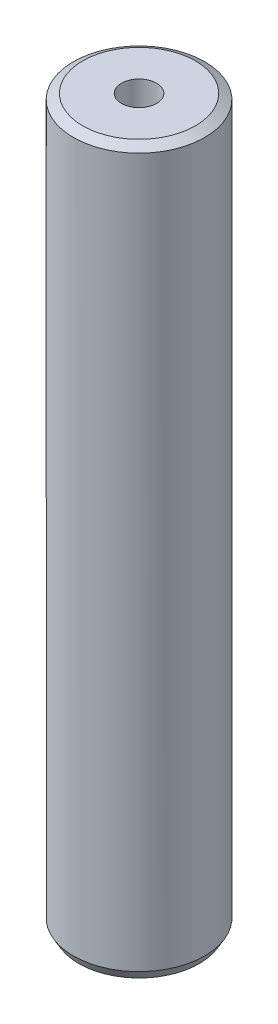
ISO-10303-21;
HEADER;
FILE_DESCRIPTION(('STEP AP214'),'2;1');
FILE_NAME('part.step','',(''),(''),'','','');
FILE_SCHEMA(('AUTOMOTIVE_DESIGN { 1 0 10303 214 1 1 1 1 }'));
ENDSEC;
DATA;
#1=APPLICATION_CONTEXT('core data for automotive mechanical design processes');
#2=APPLICATION_PROTOCOL_DEFINITION('international standard','automotive_design',2000,#1);
#3=PRODUCT_CONTEXT('',#1,'mechanical');
#4=PRODUCT('Part','Part','',(#3));
#5=PRODUCT_RELATED_PRODUCT_CATEGORY('part','',(#4));
#6=PRODUCT_DEFINITION_FORMATION('','',#4);
#7=PRODUCT_DEFINITION_CONTEXT('part definition',#1,'design');
#8=PRODUCT_DEFINITION('design','',#6,#7);
#9=PRODUCT_DEFINITION_SHAPE('','',#8);
#10=(LENGTH_UNIT() NAMED_UNIT(*) SI_UNIT(.MILLI.,.METRE.));
#11=(NAMED_UNIT(*) PLANE_ANGLE_UNIT() SI_UNIT($,.RADIAN.));
#12=(NAMED_UNIT(*) SI_UNIT($,.STERADIAN.) SOLID_ANGLE_UNIT());
#13=UNCERTAINTY_MEASURE_WITH_UNIT(LENGTH_MEASURE(1.E-05),#10,'distance_accuracy_value','');
#14=(GEOMETRIC_REPRESENTATION_CONTEXT(3) GLOBAL_UNCERTAINTY_ASSIGNED_CONTEXT((#13)) GLOBAL_UNIT_ASSIGNED_CONTEXT((#10,
#11,#12)) REPRESENTATION_CONTEXT('',''));
#15=CARTESIAN_POINT('',(0.,0.,0.));
#16=DIRECTION('',(0.,0.,1.));
#17=DIRECTION('',(1.,0.,0.));
#18=AXIS2_PLACEMENT_3D('',#15,#16,#17);
#19=CARTESIAN_POINT('',(0.,110.16894123625,0.));
#20=DIRECTION('',(0.,-1.,0.));
#21=DIRECTION('',(0.,0.,-1.));
#22=AXIS2_PLACEMENT_3D('',#19,#20,#21);
#23=CYLINDRICAL_SURFACE('',#22,10.);
#24=CARTESIAN_POINT('',(0.,109.347230085721,0.));
#25=DIRECTION('',(0.,1.,0.));
#26=DIRECTION('',(0.,0.,1.));
#27=AXIS2_PLACEMENT_3D('',#24,#25,#26);
#28=CIRCLE('',#27,10.);
#29=CARTESIAN_POINT('',(0.,109.347230085721,-10.));
#30=VERTEX_POINT('',#29);
#31=EDGE_CURVE('E50',#30,#30,#28,.F.);
#32=CARTESIAN_POINT('',(0.,1.42324546186122,0.));
#33=DIRECTION('',(0.,1.,0.));
#34=DIRECTION('',(0.,0.,1.));
#35=AXIS2_PLACEMENT_3D('',#32,#33,#34);
#36=CIRCLE('',#35,10.);
#37=CARTESIAN_POINT('',(0.,1.42324546186121,-10.));
#38=VERTEX_POINT('',#37);
#39=EDGE_CURVE('E51',#38,#38,#36,.T.);
#40=CARTESIAN_POINT('',(0.,109.347230085721,-10.));
#41=CARTESIAN_POINT('',(0.,108.223021912556,-10.));
#42=CARTESIAN_POINT('',(0.,107.098813739391,-10.));
#43=CARTESIAN_POINT('',(0.,104.850397393061,-10.));
#44=CARTESIAN_POINT('',(0.,103.726189219895,-10.));
#45=CARTESIAN_POINT('',(0.,101.477772873565,-10.));
#46=CARTESIAN_POINT('',(0.,100.3535647004,-10.));
#47=CARTESIAN_POINT('',(0.,98.1051483540693,-10.));
#48=CARTESIAN_POINT('',(0.,96.9809401809041,-10.));
#49=CARTESIAN_POINT('',(0.,94.7325238345737,-10.));
#50=CARTESIAN_POINT('',(0.,93.6083156614085,-10.));
#51=CARTESIAN_POINT('',(0.,91.3598993150781,-10.));
#52=CARTESIAN_POINT('',(0.,90.2356911419128,-10.));
#53=CARTESIAN_POINT('',(0.,87.9872747955824,-10.));
#54=CARTESIAN_POINT('',(0.,86.8630666224172,-10.));
#55=CARTESIAN_POINT('',(0.,84.6146502760868,-10.));
#56=CARTESIAN_POINT('',(0.,83.4904421029216,-10.));
#57=CARTESIAN_POINT('',(0.,81.2420257565912,-10.));
#58=CARTESIAN_POINT('',(0.,80.1178175834259,-10.));
#59=CARTESIAN_POINT('',(0.,77.8694012370955,-10.));
#60=CARTESIAN_POINT('',(0.,76.7451930639303,-10.));
#61=CARTESIAN_POINT('',(0.,74.4967767175999,-10.));
#62=CARTESIAN_POINT('',(0.,73.3725685444347,-10.));
#63=CARTESIAN_POINT('',(0.,71.1241521981043,-10.));
#64=CARTESIAN_POINT('',(0.,69.999944024939,-10.));
#65=CARTESIAN_POINT('',(0.,67.7515276786086,-10.));
#66=CARTESIAN_POINT('',(0.,66.6273195054434,-10.));
#67=CARTESIAN_POINT('',(0.,64.378903159113,-10.));
#68=CARTESIAN_POINT('',(0.,63.2546949859478,-10.));
#69=CARTESIAN_POINT('',(0.,61.0062786396174,-10.));
#70=CARTESIAN_POINT('',(0.,59.8820704664522,-10.));
#71=CARTESIAN_POINT('',(0.,57.6336541201217,-10.));
#72=CARTESIAN_POINT('',(0.,56.5094459469565,-10.));
#73=CARTESIAN_POINT('',(0.,54.2610296006261,-10.));
#74=CARTESIAN_POINT('',(0.,53.1368214274609,-10.));
#75=CARTESIAN_POINT('',(0.,50.8884050811305,-10.));
#76=CARTESIAN_POINT('',(0.,49.7641969079653,-10.));
#77=CARTESIAN_POINT('',(0.,47.5157805616348,-10.));
#78=CARTESIAN_POINT('',(0.,46.3915723884696,-10.));
#79=CARTESIAN_POINT('',(0.,44.1431560421392,-10.));
#80=CARTESIAN_POINT('',(0.,43.018947868974,-10.));
#81=CARTESIAN_POINT('',(0.,40.7705315226436,-10.));
#82=CARTESIAN_POINT('',(0.,39.6463233494784,-10.));
#83=CARTESIAN_POINT('',(0.,37.3979070031479,-10.));
#84=CARTESIAN_POINT('',(0.,36.2736988299827,-10.));
#85=CARTESIAN_POINT('',(0.,34.0252824836523,-10.));
#86=CARTESIAN_POINT('',(0.,32.9010743104871,-10.));
#87=CARTESIAN_POINT('',(0.,30.6526579641567,-10.));
#88=CARTESIAN_POINT('',(0.,29.5284497909915,-10.));
#89=CARTESIAN_POINT('',(0.,27.2800334446611,-10.));
#90=CARTESIAN_POINT('',(0.,26.1558252714958,-10.));
#91=CARTESIAN_POINT('',(0.,23.9074089251654,-10.));
#92=CARTESIAN_POINT('',(0.,22.7832007520002,-10.));
#93=CARTESIAN_POINT('',(0.,20.5347844056698,-10.));
#94=CARTESIAN_POINT('',(0.,19.4105762325046,-10.));
#95=CARTESIAN_POINT('',(0.,17.1621598861742,-10.));
#96=CARTESIAN_POINT('',(0.,16.0379517130089,-10.));
#97=CARTESIAN_POINT('',(0.,13.7895353666785,-10.));
#98=CARTESIAN_POINT('',(0.,12.6653271935133,-10.));
#99=CARTESIAN_POINT('',(0.,10.4169108471829,-10.));
#100=CARTESIAN_POINT('',(0.,9.29270267401768,-10.));
#101=CARTESIAN_POINT('',(0.,7.04428632768726,-10.));
#102=CARTESIAN_POINT('',(0.,5.92007815452205,-10.));
#103=CARTESIAN_POINT('',(0.,3.67166180819163,-10.));
#104=CARTESIAN_POINT('',(0.,2.54745363502642,-10.));
#105=CARTESIAN_POINT('',(0.,1.42324546186121,-10.));
#106=B_SPLINE_CURVE_WITH_KNOTS('',3,(#40,#41,#42,#43,#44,#45,#46,#47,#48,#49,#50,#51,#52,#53,
#54,#55,#56,#57,#58,#59,#60,#61,#62,#63,#64,#65,#66,#67,#68,#69,#70,#71,#72,#73,#74,#75,#76,#77,
#78,#79,#80,#81,#82,#83,#84,#85,#86,#87,#88,#89,#90,#91,#92,#93,#94,#95,#96,#97,#98,#99,#100,
#101,#102,#103,#104,#105),.UNSPECIFIED.,.F.,.F.,(4,2,2,2,2,2,2,2,2,2,2,2,2,2,2,2,2,2,2,2,2,2,2,
2,2,2,2,2,2,2,2,2,4),(0.,3.37262451949565,6.74524903899128,10.1178735584869,13.4904980779825,
16.8631225974782,20.2357471169738,23.6083716364694,26.9809961559651,30.3536206754607,
33.7262451949563,37.098869714452,40.4714942339476,43.8441187534432,47.2167432729389,
50.5893677924345,53.9619923119301,57.3346168314258,60.7072413509214,64.079865870417,
67.4524903899127,70.8251149094083,74.1977394289039,77.5703639483995,80.9429884678952,
84.3156129873908,87.6882375068864,91.0608620263821,94.4334865458777,97.8061110653733,
101.178735584869,104.551360104365,107.92398462386),.UNSPECIFIED.);
#107=EDGE_CURVE('BSEAM39',#30,#38,#106,.T.);
#108=ORIENTED_EDGE('',*,*,#31,.T.);
#109=ORIENTED_EDGE('',*,*,#39,.T.);
#110=ORIENTED_EDGE('',*,*,#107,.T.);
#111=ORIENTED_EDGE('',*,*,#107,.F.);
#112=EDGE_LOOP('',(#108,#110,#109,#111));
#113=FACE_BOUND('',#112,.T.);
#114=ADVANCED_FACE('F39',(#113),#23,.T.);
#115=CARTESIAN_POINT('',(0.,110.16894123625,0.));
#116=DIRECTION('',(0.,1.,0.));
#117=DIRECTION('',(0.,0.,1.));
#118=AXIS2_PLACEMENT_3D('',#115,#116,#117);
#119=PLANE('',#118);
#120=CARTESIAN_POINT('',(0.,110.16894123625,0.));
#121=DIRECTION('',(0.,1.,0.));
#122=DIRECTION('',(0.,0.,1.));
#123=AXIS2_PLACEMENT_3D('',#120,#121,#122);
#124=CIRCLE('',#123,8.57675453813905);
#125=CARTESIAN_POINT('',(0.,110.16894123625,8.57675453813905));
#126=VERTEX_POINT('',#125);
#127=EDGE_CURVE('E54',#126,#126,#124,.T.);
#128=ORIENTED_EDGE('',*,*,#127,.T.);
#129=EDGE_LOOP('',(#128));
#130=FACE_BOUND('',#129,.T.);
#131=CARTESIAN_POINT('',(0.,110.16894123625,0.));
#132=DIRECTION('',(0.,1.,0.));
#133=DIRECTION('',(0.,0.,1.));
#134=AXIS2_PLACEMENT_3D('',#131,#132,#133);
#135=CIRCLE('',#134,2.6719420239943);
#136=CARTESIAN_POINT('',(0.,110.16894123625,-2.6719420239943));
#137=VERTEX_POINT('',#136);
#138=EDGE_CURVE('E58',#137,#137,#135,.T.);
#139=ORIENTED_EDGE('',*,*,#138,.F.);
#140=EDGE_LOOP('',(#139));
#141=FACE_BOUND('',#140,.T.);
#142=ADVANCED_FACE('F69',(#130,#141),#119,.T.);
#143=CARTESIAN_POINT('',(0.,0.,0.));
#144=DIRECTION('',(0.,1.,0.));
#145=DIRECTION('',(0.,0.,1.));
#146=AXIS2_PLACEMENT_3D('',#143,#144,#145);
#147=PLANE('',#146);
#148=CARTESIAN_POINT('',(0.,0.,0.));
#149=DIRECTION('',(0.,1.,0.));
#150=DIRECTION('',(0.,0.,1.));
#151=AXIS2_PLACEMENT_3D('',#148,#149,#150);
#152=CIRCLE('',#151,9.1782888494715);
#153=CARTESIAN_POINT('',(0.,0.,9.1782888494715));
#154=VERTEX_POINT('',#153);
#155=EDGE_CURVE('E10',#154,#154,#152,.F.);
#156=ORIENTED_EDGE('',*,*,#155,.T.);
#157=EDGE_LOOP('',(#156));
#158=FACE_BOUND('',#157,.T.);
#159=CARTESIAN_POINT('',(0.,0.,0.));
#160=DIRECTION('',(0.,1.,0.));
#161=DIRECTION('',(0.,0.,1.));
#162=AXIS2_PLACEMENT_3D('',#159,#160,#161);
#163=CIRCLE('',#162,2.6719420239943);
#164=CARTESIAN_POINT('',(0.,0.,-2.6719420239943));
#165=VERTEX_POINT('',#164);
#166=EDGE_CURVE('E63',#165,#165,#163,.T.);
#167=ORIENTED_EDGE('',*,*,#166,.T.);
#168=EDGE_LOOP('',(#167));
#169=FACE_BOUND('',#168,.T.);
#170=ADVANCED_FACE('F75',(#158,#169),#147,.F.);
#171=CARTESIAN_POINT('',(0.,110.16894123625,0.));
#172=DIRECTION('',(0.,-1.,0.));
#173=DIRECTION('',(0.,0.,-1.));
#174=AXIS2_PLACEMENT_3D('',#171,#172,#173);
#175=CYLINDRICAL_SURFACE('',#174,2.6719420239943);
#176=CARTESIAN_POINT('',(0.,110.16894123625,-2.6719420239943));
#177=CARTESIAN_POINT('',(0.,109.021348098372,-2.6719420239943));
#178=CARTESIAN_POINT('',(0.,107.873754960495,-2.6719420239943));
#179=CARTESIAN_POINT('',(0.,105.578568684739,-2.6719420239943));
#180=CARTESIAN_POINT('',(0.,104.430975546862,-2.6719420239943));
#181=CARTESIAN_POINT('',(0.,102.135789271107,-2.6719420239943));
#182=CARTESIAN_POINT('',(0.,100.988196133229,-2.6719420239943));
#183=CARTESIAN_POINT('',(0.,98.6930098574738,-2.6719420239943));
#184=CARTESIAN_POINT('',(0.,97.5454167195961,-2.6719420239943));
#185=CARTESIAN_POINT('',(0.,95.2502304438409,-2.6719420239943));
#186=CARTESIAN_POINT('',(0.,94.1026373059633,-2.6719420239943));
#187=CARTESIAN_POINT('',(0.,91.8074510302081,-2.6719420239943));
#188=CARTESIAN_POINT('',(0.,90.6598578923305,-2.6719420239943));
#189=CARTESIAN_POINT('',(0.,88.3646716165753,-2.6719420239943));
#190=CARTESIAN_POINT('',(0.,87.2170784786977,-2.6719420239943));
#191=CARTESIAN_POINT('',(0.,84.9218922029425,-2.6719420239943));
#192=CARTESIAN_POINT('',(0.,83.7742990650649,-2.6719420239943));
#193=CARTESIAN_POINT('',(0.,81.4791127893097,-2.6719420239943));
#194=CARTESIAN_POINT('',(0.,80.3315196514321,-2.6719420239943));
#195=CARTESIAN_POINT('',(0.,78.0363333756769,-2.6719420239943));
#196=CARTESIAN_POINT('',(0.,76.8887402377993,-2.6719420239943));
#197=CARTESIAN_POINT('',(0.,74.5935539620441,-2.6719420239943));
#198=CARTESIAN_POINT('',(0.,73.4459608241665,-2.6719420239943));
#199=CARTESIAN_POINT('',(0.,71.1507745484113,-2.6719420239943));
#200=CARTESIAN_POINT('',(0.,70.0031814105337,-2.6719420239943));
#201=CARTESIAN_POINT('',(0.,67.7079951347785,-2.6719420239943));
#202=CARTESIAN_POINT('',(0.,66.5604019969009,-2.6719420239943));
#203=CARTESIAN_POINT('',(0.,64.2652157211457,-2.6719420239943));
#204=CARTESIAN_POINT('',(0.,63.1176225832681,-2.6719420239943));
#205=CARTESIAN_POINT('',(0.,60.8224363075129,-2.6719420239943));
#206=CARTESIAN_POINT('',(0.,59.6748431696353,-2.6719420239943));
#207=CARTESIAN_POINT('',(0.,57.3796568938801,-2.6719420239943));
#208=CARTESIAN_POINT('',(0.,56.2320637560025,-2.6719420239943));
#209=CARTESIAN_POINT('',(0.,53.9368774802473,-2.6719420239943));
#210=CARTESIAN_POINT('',(0.,52.7892843423697,-2.6719420239943));
#211=CARTESIAN_POINT('',(0.,50.4940980666145,-2.6719420239943));
#212=CARTESIAN_POINT('',(0.,49.3465049287369,-2.6719420239943));
#213=CARTESIAN_POINT('',(0.,47.0513186529817,-2.6719420239943));
#214=CARTESIAN_POINT('',(0.,45.9037255151041,-2.6719420239943));
#215=CARTESIAN_POINT('',(0.,43.6085392393489,-2.6719420239943));
#216=CARTESIAN_POINT('',(0.,42.4609461014713,-2.6719420239943));
#217=CARTESIAN_POINT('',(0.,40.1657598257161,-2.6719420239943));
#218=CARTESIAN_POINT('',(0.,39.0181666878385,-2.6719420239943));
#219=CARTESIAN_POINT('',(0.,36.7229804120833,-2.6719420239943));
#220=CARTESIAN_POINT('',(0.,35.5753872742057,-2.6719420239943));
#221=CARTESIAN_POINT('',(0.,33.2802009984505,-2.6719420239943));
#222=CARTESIAN_POINT('',(0.,32.1326078605729,-2.6719420239943));
#223=CARTESIAN_POINT('',(0.,29.8374215848177,-2.6719420239943));
#224=CARTESIAN_POINT('',(0.,28.68982844694,-2.6719420239943));
#225=CARTESIAN_POINT('',(0.,26.3946421711848,-2.6719420239943));
#226=CARTESIAN_POINT('',(0.,25.2470490333072,-2.6719420239943));
#227=CARTESIAN_POINT('',(0.,22.951862757552,-2.6719420239943));
#228=CARTESIAN_POINT('',(0.,21.8042696196744,-2.6719420239943));
#229=CARTESIAN_POINT('',(0.,19.5090833439192,-2.6719420239943));
#230=CARTESIAN_POINT('',(0.,18.3614902060416,-2.6719420239943));
#231=CARTESIAN_POINT('',(0.,16.0663039302864,-2.6719420239943));
#232=CARTESIAN_POINT('',(0.,14.9187107924088,-2.6719420239943));
#233=CARTESIAN_POINT('',(0.,12.6235245166536,-2.6719420239943));
#234=CARTESIAN_POINT('',(0.,11.475931378776,-2.6719420239943));
#235=CARTESIAN_POINT('',(0.,9.18074510302082,-2.6719420239943));
#236=CARTESIAN_POINT('',(0.,8.03315196514322,-2.6719420239943));
#237=CARTESIAN_POINT('',(0.,5.73796568938801,-2.6719420239943));
#238=CARTESIAN_POINT('',(0.,4.59037255151041,-2.6719420239943));
#239=CARTESIAN_POINT('',(0.,2.2951862757552,-2.6719420239943));
#240=CARTESIAN_POINT('',(0.,1.1475931378776,-2.6719420239943));
#241=CARTESIAN_POINT('',(0.,0.,-2.6719420239943));
#242=B_SPLINE_CURVE_WITH_KNOTS('',3,(#176,#177,#178,#179,#180,#181,#182,#183,#184,#185,#186,
#187,#188,#189,#190,#191,#192,#193,#194,#195,#196,#197,#198,#199,#200,#201,#202,#203,#204,#205,
#206,#207,#208,#209,#210,#211,#212,#213,#214,#215,#216,#217,#218,#219,#220,#221,#222,#223,#224,
#225,#226,#227,#228,#229,#230,#231,#232,#233,#234,#235,#236,#237,#238,#239,#240,#241),
.UNSPECIFIED.,.F.,.F.,(4,2,2,2,2,2,2,2,2,2,2,2,2,2,2,2,2,2,2,2,2,2,2,2,2,2,2,2,2,2,2,2,4),(0.,
3.44277941363282,6.88555882726562,10.3283382408984,13.7711176545312,17.213897068164,
20.6566764817968,24.0994558954297,27.5422353090625,30.9850147226953,34.4277941363281,
37.8705735499609,41.3133529635937,44.7561323772265,48.1989117908593,51.6416912044921,
55.0844706181249,58.5272500317577,61.9700294453905,65.4128088590233,68.8555882726561,
72.2983676862889,75.7411470999217,79.1839265135545,82.6267059271873,86.0694853408201,
89.5122647544529,92.9550441680857,96.3978235817186,99.8406029953514,103.283382408984,
106.726161822617,110.16894123625),.UNSPECIFIED.);
#243=EDGE_CURVE('BSEAM70',#137,#165,#242,.T.);
#244=ORIENTED_EDGE('',*,*,#138,.T.);
#245=ORIENTED_EDGE('',*,*,#166,.F.);
#246=ORIENTED_EDGE('',*,*,#243,.T.);
#247=ORIENTED_EDGE('',*,*,#243,.F.);
#248=EDGE_LOOP('',(#244,#246,#245,#247));
#249=FACE_BOUND('',#248,.T.);
#250=ADVANCED_FACE('F70',(#249),#175,.F.);
#251=CARTESIAN_POINT('',(0.,110.16894123625,0.));
#252=DIRECTION('',(0.,-1.,0.));
#253=DIRECTION('',(0.,0.,-1.));
#254=AXIS2_PLACEMENT_3D('',#251,#252,#253);
#255=CONICAL_SURFACE('',#254,8.57675453813905,1.04719755119659);
#256=ORIENTED_EDGE('',*,*,#31,.F.);
#257=EDGE_LOOP('',(#256));
#258=FACE_BOUND('',#257,.T.);
#259=ORIENTED_EDGE('',*,*,#127,.F.);
#260=EDGE_LOOP('',(#259));
#261=FACE_BOUND('',#260,.T.);
#262=ADVANCED_FACE('F81',(#258,#261),#255,.T.);
#263=CARTESIAN_POINT('',(0.,1.42324546186122,0.));
#264=DIRECTION('',(0.,1.,0.));
#265=DIRECTION('',(0.,0.,1.));
#266=AXIS2_PLACEMENT_3D('',#263,#264,#265);
#267=CONICAL_SURFACE('',#266,10.,0.523598775598306);
#268=ORIENTED_EDGE('',*,*,#155,.F.);
#269=EDGE_LOOP('',(#268));
#270=FACE_BOUND('',#269,.T.);
#271=ORIENTED_EDGE('',*,*,#39,.F.);
#272=EDGE_LOOP('',(#271));
#273=FACE_BOUND('',#272,.T.);
#274=ADVANCED_FACE('F45',(#270,#273),#267,.T.);
#275=CLOSED_SHELL('',(#114,#142,#170,#250,#262,#274));
#276=MANIFOLD_SOLID_BREP('B2',#275);
#277=ADVANCED_BREP_SHAPE_REPRESENTATION('',(#18,#276),#14);
#278=SHAPE_DEFINITION_REPRESENTATION(#9,#277);
ENDSEC;
END-ISO-10303-21;
